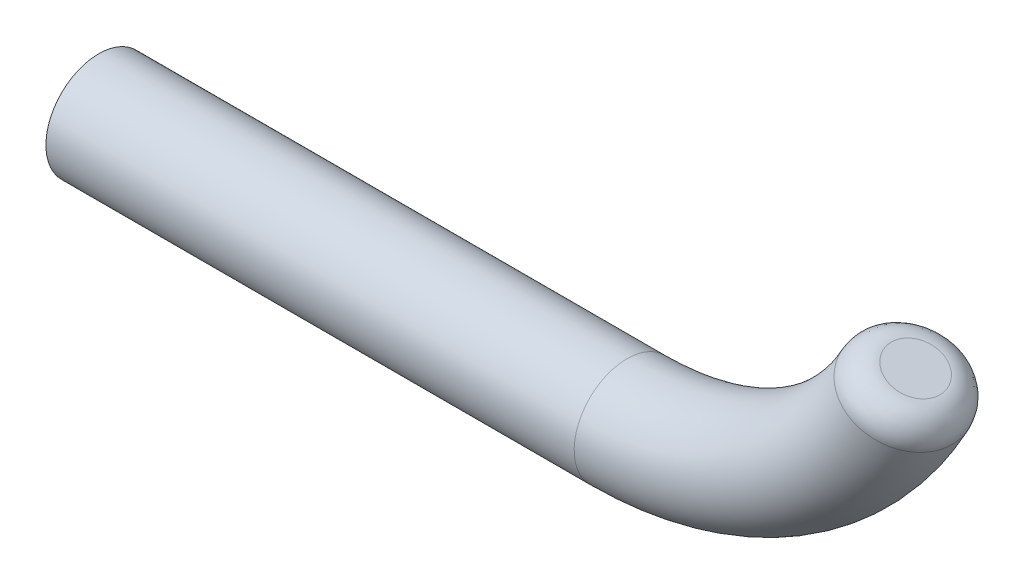
ISO-10303-21;
HEADER;
FILE_DESCRIPTION(('STEP AP214'),'2;1');
FILE_NAME('part.step','',(''),(''),'','','');
FILE_SCHEMA(('AUTOMOTIVE_DESIGN { 1 0 10303 214 1 1 1 1 }'));
ENDSEC;
DATA;
#1=APPLICATION_CONTEXT('core data for automotive mechanical design processes');
#2=APPLICATION_PROTOCOL_DEFINITION('international standard','automotive_design',2000,#1);
#3=PRODUCT_CONTEXT('',#1,'mechanical');
#4=PRODUCT('Part','Part','',(#3));
#5=PRODUCT_RELATED_PRODUCT_CATEGORY('part','',(#4));
#6=PRODUCT_DEFINITION_FORMATION('','',#4);
#7=PRODUCT_DEFINITION_CONTEXT('part definition',#1,'design');
#8=PRODUCT_DEFINITION('design','',#6,#7);
#9=PRODUCT_DEFINITION_SHAPE('','',#8);
#10=(LENGTH_UNIT() NAMED_UNIT(*) SI_UNIT(.MILLI.,.METRE.));
#11=(NAMED_UNIT(*) PLANE_ANGLE_UNIT() SI_UNIT($,.RADIAN.));
#12=(NAMED_UNIT(*) SI_UNIT($,.STERADIAN.) SOLID_ANGLE_UNIT());
#13=UNCERTAINTY_MEASURE_WITH_UNIT(LENGTH_MEASURE(1.E-05),#10,'distance_accuracy_value','');
#14=(GEOMETRIC_REPRESENTATION_CONTEXT(3) GLOBAL_UNCERTAINTY_ASSIGNED_CONTEXT((#13)) GLOBAL_UNIT_ASSIGNED_CONTEXT((#10,
#11,#12)) REPRESENTATION_CONTEXT('',''));
#15=CARTESIAN_POINT('',(0.,0.,0.));
#16=DIRECTION('',(0.,0.,1.));
#17=DIRECTION('',(1.,0.,0.));
#18=AXIS2_PLACEMENT_3D('',#15,#16,#17);
#19=CARTESIAN_POINT('',(50.,25.,0.));
#20=DIRECTION('',(0.,0.,1.));
#21=DIRECTION('',(1.,0.,0.));
#22=AXIS2_PLACEMENT_3D('',#19,#20,#21);
#23=TOROIDAL_SURFACE('',#22,30.,5.);
#24=CARTESIAN_POINT('',(76.6091500946722,10.4224753880065,-4.98838670516629));
#25=CARTESIAN_POINT('',(77.631107553344,12.7195077540693,-5.00254478206829));
#26=CARTESIAN_POINT('',(77.4751472118108,12.7888234614174,-2.49419335258314));
#27=CARTESIAN_POINT('',(76.356901789823,10.547262348215,-5.00758432939226));
#28=CARTESIAN_POINT('',(77.373301598546,12.8340881784239,-5.01009064987202));
#29=CARTESIAN_POINT('',(77.346230607861,12.8461197298395,-2.50379216469613));
#30=CARTESIAN_POINT('',(76.1032877470817,10.6729073912422,-5.00295105048083));
#31=CARTESIAN_POINT('',(77.1152445866172,12.9487801837256,-4.99366594447582));
#32=CARTESIAN_POINT('',(77.2165727009147,12.9037454662601,-2.50147552524041));
#33=CARTESIAN_POINT('',(75.6005186439998,10.9223640527387,-4.94616423498344));
#34=CARTESIAN_POINT('',(76.6071087164915,13.1746183482259,-4.9138708016165));
#35=CARTESIAN_POINT('',(76.9594470454854,13.0180235353398,-2.47308211749173));
#36=CARTESIAN_POINT('',(75.351363626584,11.0461756535563,-4.8940102411893));
#37=CARTESIAN_POINT('',(76.3569975705863,13.2857788575171,-4.85072090842978));
#38=CARTESIAN_POINT('',(76.8319793180867,13.0746758586281,-2.44700512059467));
#39=CARTESIAN_POINT('',(74.8643061594002,11.2885701066347,-4.74356099719807));
#40=CARTESIAN_POINT('',(75.8713177351337,13.5016365621627,-4.68011539458172));
#41=CARTESIAN_POINT('',(76.5827139711742,13.1854604572559,-2.37178049859902));
#42=CARTESIAN_POINT('',(74.626415938627,11.4071472673683,-4.64521681255998));
#43=CARTESIAN_POINT('',(75.6356664191347,13.6063704803845,-4.57280660680407));
#44=CARTESIAN_POINT('',(76.4609225159492,13.2395899929114,-2.32260840627992));
#45=CARTESIAN_POINT('',(74.1689256155032,11.6355138206843,-4.40511984167079));
#46=CARTESIAN_POINT('',(75.1853646692633,13.8065045914385,-4.31769846732381));
#47=CARTESIAN_POINT('',(76.226624664223,13.3437223714564,-2.20255992083536));
#48=CARTESIAN_POINT('',(73.9493254574729,11.7453032400189,-4.26336718757261));
#49=CARTESIAN_POINT('',(74.9705632017953,13.9019719103131,-4.17004393481717));
#50=CARTESIAN_POINT('',(76.1141182394558,13.3937252269085,-2.13168359378636));
#51=CARTESIAN_POINT('',(73.5349268201631,11.9527581373375,-3.94063181431727));
#52=CARTESIAN_POINT('',(74.567603645207,14.0810650465746,-3.83916843315687));
#53=CARTESIAN_POINT('',(75.9017456245872,13.488113055739,-1.97031590715858));
#54=CARTESIAN_POINT('',(73.3400977770043,12.0504385522409,-3.75969819902843));
#55=CARTESIAN_POINT('',(74.3792267628583,14.1647881053963,-3.65607059637285));
#56=CARTESIAN_POINT('',(75.8018638584429,13.5325049518031,-1.87984909951395));
#57=CARTESIAN_POINT('',(72.980485455259,12.2309451522492,-3.36358960079611));
#58=CARTESIAN_POINT('',(74.03333579578,14.3185174240977,-3.2596121209378));
#59=CARTESIAN_POINT('',(75.6174531745704,13.6144652557464,-1.68179480039783));
#60=CARTESIAN_POINT('',(72.8157017029596,12.3137715715512,-3.14841515781513));
#61=CARTESIAN_POINT('',(73.8756195146365,14.3886135490504,-3.04625351401021));
#62=CARTESIAN_POINT('',(75.5329240147835,13.6520337712073,-1.5742075789076));
#63=CARTESIAN_POINT('',(72.5213939902876,12.4618412251153,-2.69067315675977));
#64=CARTESIAN_POINT('',(73.595165453396,14.5132597984906,-2.59598533121115));
#65=CARTESIAN_POINT('',(75.3819191790676,13.7191470315255,-1.34533657837985));
#66=CARTESIAN_POINT('',(72.3917568364636,12.5271408992107,-2.44819718516319));
#67=CARTESIAN_POINT('',(73.4721250089007,14.5679444404886,-2.35908163520195));
#68=CARTESIAN_POINT('',(75.315385548257,13.7487175341079,-1.22409859258124));
#69=CARTESIAN_POINT('',(72.170760829213,12.6385346114708,-1.94216842952516));
#70=CARTESIAN_POINT('',(73.2630834083977,14.6608518184899,-1.86747278758659));
#71=CARTESIAN_POINT('',(75.2019455597456,13.7991353067797,-0.971084214762206));
#72=CARTESIAN_POINT('',(72.0794010760938,12.6846291010443,-1.67861614104623));
#73=CARTESIAN_POINT('',(73.1769209559551,14.6991462417977,-1.61262395394021));
#74=CARTESIAN_POINT('',(75.1550387407256,13.8199827818997,-0.83930807052305));
#75=CARTESIAN_POINT('',(71.9378699513474,12.7560641788695,-1.13899970947719));
#76=CARTESIAN_POINT('',(73.0437451042193,14.7583355092358,-1.0927207434233));
#77=CARTESIAN_POINT('',(75.0823658515969,13.8522818437347,-0.569499854738662));
#78=CARTESIAN_POINT('',(71.8875422586259,12.7814835329288,-0.86298732042111));
#79=CARTESIAN_POINT('',(72.9964739813203,14.7793448971909,-0.827515092757897));
#80=CARTESIAN_POINT('',(75.0565195468187,13.8637690903027,-0.431493660210455));
#81=CARTESIAN_POINT('',(71.8289397774365,12.8110841560056,-0.305379871431318));
#82=CARTESIAN_POINT('',(72.9414908429261,14.8037818475884,-0.292662924922308));
#83=CARTESIAN_POINT('',(75.0264231871125,13.8771452501722,-0.152689935715468));
#84=CARTESIAN_POINT('',(71.8206643558029,12.8152657447923,-0.0237848956166572));
#85=CARTESIAN_POINT('',(72.9337311842532,14.8072305847763,-0.0227907033975826));
#86=CARTESIAN_POINT('',(75.0221728070225,13.8790343079899,-0.0118924478082163));
#87=CARTESIAN_POINT('',(71.8463725417252,12.8022787123746,0.536272138120834));
#88=CARTESIAN_POINT('',(72.9578400879266,14.796515516477,0.514022580885138));
#89=CARTESIAN_POINT('',(75.0353760977587,13.8731661787739,0.268136069060305));
#90=CARTESIAN_POINT('',(71.8802542396975,12.7851615781752,0.814740115610773));
#91=CARTESIAN_POINT('',(72.9896337361098,14.7823850061734,0.781198853673681));
#92=CARTESIAN_POINT('',(75.0527774282734,13.8654322541007,0.407370057805128));
#93=CARTESIAN_POINT('',(71.9891303804021,12.7301882890893,1.36133191204199));
#94=CARTESIAN_POINT('',(73.0919364536641,14.7369171317048,1.3066667070718));
#95=CARTESIAN_POINT('',(75.1086876428653,13.8405832698376,0.680665956020831));
#96=CARTESIAN_POINT('',(72.0641248305328,12.6923321304709,1.62945572912178));
#97=CARTESIAN_POINT('',(73.1625308894193,14.7055418269247,1.56516678123908));
#98=CARTESIAN_POINT('',(75.1471965307409,13.8234682085596,0.814727864560972));
#99=CARTESIAN_POINT('',(72.2531150437608,12.5970137362364,2.14787130308926));
#100=CARTESIAN_POINT('',(73.3408778583628,14.6262765073943,2.0669109023628));
#101=CARTESIAN_POINT('',(75.2442214138795,13.7803460382757,1.07393565154455));
#102=CARTESIAN_POINT('',(72.3671247788157,12.5395444768954,2.39815663289688));
#103=CARTESIAN_POINT('',(73.4487836992752,14.5783183558777,2.31031387387243));
#104=CARTESIAN_POINT('',(75.3027445765491,13.7543357437559,1.19907831644795));
#105=CARTESIAN_POINT('',(72.6308891272829,12.4067336834491,2.87374470586114));
#106=CARTESIAN_POINT('',(73.6993213385505,14.4669682939775,2.77554533381964));
#107=CARTESIAN_POINT('',(75.4381041304061,13.6941759420417,1.43687235293006));
#108=CARTESIAN_POINT('',(72.7806428085271,12.3313926154237,3.09904810029841));
#109=CARTESIAN_POINT('',(73.842130434662,14.4034975845946,2.99747693915557));
#110=CARTESIAN_POINT('',(75.5149400440145,13.6600266471046,1.54952405014908));
#111=CARTESIAN_POINT('',(73.1121220578544,12.1648408658452,3.51897809685509));
#112=CARTESIAN_POINT('',(74.1596760966832,14.2623661792518,3.41451166665942));
#113=CARTESIAN_POINT('',(75.6849641023289,13.5844603989649,1.75948904842767));
#114=CARTESIAN_POINT('',(73.2939354899221,12.0735865798173,3.71351753321379));
#115=CARTESIAN_POINT('',(74.3346959532796,14.1845795763201,3.60956650355832));
#116=CARTESIAN_POINT('',(75.7781971837586,13.543023473885,1.8567587666069));
#117=CARTESIAN_POINT('',(73.6841694510012,11.8780053588178,4.06578662940477));
#118=CARTESIAN_POINT('',(74.7123667022126,14.0167259101277,3.96675054086141));
#119=CARTESIAN_POINT('',(75.9782395459179,13.4541157573697,2.03289331470234));
#120=CARTESIAN_POINT('',(73.8925970987571,11.7736749263896,4.22350640871089));
#121=CARTESIAN_POINT('',(74.9152170208693,13.9265702129469,4.12882499960924));
#122=CARTESIAN_POINT('',(76.0850524589345,13.4066433515846,2.11175320435547));
#123=CARTESIAN_POINT('',(74.3310844314766,11.5545206364173,4.49829628650778));
#124=CARTESIAN_POINT('',(75.3445409633544,13.7357595718424,4.41581444026859));
#125=CARTESIAN_POINT('',(76.3096837474029,13.3068072233764,2.24914814325386));
#126=CARTESIAN_POINT('',(74.5612339750236,11.439653250224,4.61518720362139));
#127=CARTESIAN_POINT('',(75.571276005444,13.6349884420248,4.54044585903501));
#128=CARTESIAN_POINT('',(76.4275478245473,13.25442318909,2.30759360181053));
#129=CARTESIAN_POINT('',(75.0357338989743,11.2032020431357,4.8040087708026));
#130=CARTESIAN_POINT('',(76.0417703634302,13.4258798384754,4.74741470201166));
#131=CARTESIAN_POINT('',(76.6704597107699,13.1464623507689,2.40200438540114));
#132=CARTESIAN_POINT('',(75.2800672465498,11.0816262864289,4.87599217599118));
#133=CARTESIAN_POINT('',(76.2856318982075,13.31749693413,4.82962907699542));
#134=CARTESIAN_POINT('',(76.7954989015123,13.0908893771056,2.43799608799555));
#135=CARTESIAN_POINT('',(75.6837676572324,10.8810622537005,4.95513233444568));
#136=CARTESIAN_POINT('',(76.6909154870488,13.1373708946449,4.92659783360512));
#137=CARTESIAN_POINT('',(77.0020213453717,12.9991016242792,2.47756616722286));
#138=CARTESIAN_POINT('',(75.8409801683631,10.8030309463991,4.9764374246955));
#139=CARTESIAN_POINT('',(76.8495490538749,13.0668670871666,4.95505227148209));
#140=CARTESIAN_POINT('',(77.0824294396,12.9633646935111,2.48821871234776));
#141=CARTESIAN_POINT('',(76.1566036255897,10.6465209063145,5.00042406419231));
#142=CARTESIAN_POINT('',(77.1693818502936,12.9247191776472,4.99360335436955));
#143=CARTESIAN_POINT('',(77.2438234973438,12.8916340011805,2.50021203209615));
#144=CARTESIAN_POINT('',(76.31501457424,10.5680421725777,5.00310557373229));
#145=CARTESIAN_POINT('',(77.3305858022297,12.8530729767867,5.00364529878328));
#146=CARTESIAN_POINT('',(77.324809462091,12.8556402390706,2.50155278686614));
#147=CARTESIAN_POINT('',(76.7254770752763,10.3648811350082,4.98577160756746));
#148=CARTESIAN_POINT('',(77.7504233393442,12.666478515847,5.00533802132427));
#149=CARTESIAN_POINT('',(77.5346097333662,12.7623956740594,2.49288580378375));
#150=CARTESIAN_POINT('',(76.9772040614951,10.2404708917311,4.95131322096451));
#151=CARTESIAN_POINT('',(78.0093981531795,12.5513785985868,4.982319610925));
#152=CARTESIAN_POINT('',(77.663231679102,12.7052303648435,2.47565661048232));
#153=CARTESIAN_POINT('',(77.472284397443,9.99612211515191,4.83562296753504));
#154=CARTESIAN_POINT('',(78.522101075105,12.3235106332866,4.88813346222606));
#155=CARTESIAN_POINT('',(77.9161180784314,12.592836409586,2.41781148376758));
#156=CARTESIAN_POINT('',(77.7156273851959,9.87618910108294,4.75433527637448));
#157=CARTESIAN_POINT('',(78.7757304820169,12.2107864524369,4.81670166120926));
#158=CARTESIAN_POINT('',(78.0403771432213,12.5376101585683,2.37716763818725));
#159=CARTESIAN_POINT('',(78.1866995286211,9.64430315527754,4.54724924285328));
#160=CARTESIAN_POINT('',(79.2697838351,11.9912071843999,4.62677814689758));
#161=CARTESIAN_POINT('',(78.2808550967233,12.4307310681229,2.27362462142664));
#162=CARTESIAN_POINT('',(78.4144346036036,9.5323471975921,4.42146788750309));
#163=CARTESIAN_POINT('',(79.510067344254,11.8844145136648,4.50813839166901));
#164=CARTESIAN_POINT('',(78.3970770336734,12.3790768739229,2.21073394375158));
#165=CARTESIAN_POINT('',(78.8477605353907,9.31954914899579,4.12894032307988));
#166=CARTESIAN_POINT('',(79.9698837916361,11.6800516481617,4.22647325938261));
#167=CARTESIAN_POINT('',(78.6181662520081,12.2808149991075,2.06447016153993));
#168=CARTESIAN_POINT('',(79.0533570049078,9.21870424099346,3.96220453236078));
#169=CARTESIAN_POINT('',(80.1892357377821,11.582561894319,4.06335255107465));
#170=CARTESIAN_POINT('',(78.7230364113993,12.234206039378,1.9811022661803));
#171=CARTESIAN_POINT('',(79.4361991032911,9.03108828148828,3.59277270205361));
#172=CARTESIAN_POINT('',(80.59974935894,11.4001113960266,3.69724406263917));
#173=CARTESIAN_POINT('',(78.9182761736901,12.1474328116932,1.7963863510269));
#174=CARTESIAN_POINT('',(79.6134935487219,8.94429299288262,3.39013988166407));
#175=CARTESIAN_POINT('',(80.7907552168656,11.3152199036152,3.49428973909454));
#176=CARTESIAN_POINT('',(79.0086707455849,12.1072574464066,1.69506994083239));
#177=CARTESIAN_POINT('',(79.9350227651791,8.78699810242634,2.95443778496226));
#178=CARTESIAN_POINT('',(81.1386168801871,11.1606147199168,3.05400859322044));
#179=CARTESIAN_POINT('',(79.1725781556032,12.0344097086207,1.47721889248145));
#180=CARTESIAN_POINT('',(80.0792567519222,8.7164988871622,2.7213677868039));
#181=CARTESIAN_POINT('',(81.295269269447,11.0909914358012,2.81671954078162));
#182=CARTESIAN_POINT('',(79.246090593237,12.0017375141168,1.36068389340199));
#183=CARTESIAN_POINT('',(80.3300577916329,8.59397425760466,2.23219068889864));
#184=CARTESIAN_POINT('',(81.56857129451,10.9695238691066,2.31559206178415));
#185=CARTESIAN_POINT('',(79.3739028699883,11.9449320577829,1.11609534444928));
#186=CARTESIAN_POINT('',(80.4367402786564,8.54189222620131,1.97615727902281));
#187=CARTESIAN_POINT('',(81.6851684008477,10.9177029329565,2.05194366086648));
#188=CARTESIAN_POINT('',(79.4282615885621,11.9207726273057,0.988078639511565));
#189=CARTESIAN_POINT('',(80.6099487188469,8.45735896900637,1.44771811292601));
#190=CARTESIAN_POINT('',(81.874919401718,10.8333691547919,1.50556400797663));
#191=CARTESIAN_POINT('',(79.5165115665367,11.8815504148725,0.723859056463214));
#192=CARTESIAN_POINT('',(80.6764753678513,8.42490740304962,1.17531264049713));
#193=CARTESIAN_POINT('',(81.9479428431035,10.8009142919539,1.22299604659276));
#194=CARTESIAN_POINT('',(79.5504031806003,11.8664874752887,0.58765632024862));
#195=CARTESIAN_POINT('',(80.7673143439819,8.38060138959159,0.622588767329802));
#196=CARTESIAN_POINT('',(82.0477852458428,10.7565398907364,0.648373761501812));
#197=CARTESIAN_POINT('',(79.5966793863072,11.8459202727523,0.311294383664844));
#198=CARTESIAN_POINT('',(80.7917311376974,8.36869597093411,0.342291706811566));
#199=CARTESIAN_POINT('',(82.0746469974162,10.7446013344816,0.356543151467425));
#200=CARTESIAN_POINT('',(79.6091172007827,11.8403923552076,0.171145853405762));
#201=CARTESIAN_POINT('',(80.7979611330819,8.3656580210033,-0.218888663075993));
#202=CARTESIAN_POINT('',(82.0815027322257,10.7415543412329,-0.228014276040381));
#203=CARTESIAN_POINT('',(79.6122907950802,11.8389818688532,-0.109444331537957));
#204=CARTESIAN_POINT('',(80.7797747615065,8.3745252816502,-0.499771966544767));
#205=CARTESIAN_POINT('',(82.0614921933869,10.7504479140502,-0.52052838727934));
#206=CARTESIAN_POINT('',(79.6030267922892,11.843099203427,-0.249885983272321));
#207=CARTESIAN_POINT('',(80.7013702685218,8.41276427634166,-1.05385090354539));
#208=CARTESIAN_POINT('',(81.9752900929987,10.7887599586672,-1.09684936073511));
#209=CARTESIAN_POINT('',(79.5630856129687,11.8608508386805,-0.526925451772756));
#210=CARTESIAN_POINT('',(80.6411952519301,8.44211498243986,-1.32705412237129));
#211=CARTESIAN_POINT('',(81.9092078583558,10.8181298407307,-1.38046291183549));
#212=CARTESIAN_POINT('',(79.5324303962889,11.8744753794271,-0.663527061185853));
#213=CARTESIAN_POINT('',(80.4806091811237,8.52047878715269,-1.85833181167985));
#214=CARTESIAN_POINT('',(81.7331751663498,10.8963665927333,-1.93035469606791));
#215=CARTESIAN_POINT('',(79.4506136847243,11.9108383623447,-0.929165905840098));
#216=CARTESIAN_POINT('',(80.380198040656,8.56949192791697,-2.11640624973013));
#217=CARTESIAN_POINT('',(81.6233464568337,10.9451793525183,-2.19646480820142));
#218=CARTESIAN_POINT('',(79.3994521458809,11.9335768240529,-1.05820312486505));
#219=CARTESIAN_POINT('',(80.1419570833251,8.68585978461289,-2.61032714570713));
#220=CARTESIAN_POINT('',(81.3634871299633,11.0606723866829,-2.70330472941765));
#221=CARTESIAN_POINT('',(79.2780455512817,11.9875353105414,-1.30516357285358));
#222=CARTESIAN_POINT('',(80.0040986500024,8.75322852764294,-2.84615641788241));
#223=CARTESIAN_POINT('',(81.2135941448274,11.1272914911877,-2.94389984806235));
#224=CARTESIAN_POINT('',(79.2077859011096,12.018761821729,-1.42307820894143));
#225=CARTESIAN_POINT('',(79.6949780527742,8.90441614955162,-3.28872728590767));
#226=CARTESIAN_POINT('',(80.8787346002206,11.2761179554574,-3.39224542388501));
#227=CARTESIAN_POINT('',(79.0502127350513,12.0887943399771,-1.64436364295407));
#228=CARTESIAN_POINT('',(79.5237155617867,8.98823518950642,-3.49546859690342));
#229=CARTESIAN_POINT('',(80.6939642381127,11.3582381163943,-3.59994633975824));
#230=CARTESIAN_POINT('',(78.9628990521774,12.1276004212544,-1.74773429845175));
#231=CARTESIAN_POINT('',(79.1522737725845,9.1702078650495,-3.87451713394367));
#232=CARTESIAN_POINT('',(80.2950460123752,11.535535105611,-3.97698025648032));
#233=CARTESIAN_POINT('',(78.77348642001,12.2117838133288,-1.9372585669718));
#234=CARTESIAN_POINT('',(78.9520287065777,9.26839410868431,-4.0467438602101));
#235=CARTESIAN_POINT('',(80.0810339465901,11.6306515792932,-4.14624813115568));
#236=CARTESIAN_POINT('',(78.6713538420628,12.2571760701942,-2.02337193010515));
#237=CARTESIAN_POINT('',(78.5286545407001,9.47622711095056,-4.35136002266356));
#238=CARTESIAN_POINT('',(79.6309376550191,11.830694375547,-4.44126662007328));
#239=CARTESIAN_POINT('',(78.4553605119204,12.3531731058131,-2.17568001133191));
#240=CARTESIAN_POINT('',(78.3055250702377,9.58587405517793,-4.48374881357562));
#241=CARTESIAN_POINT('',(79.3950413519867,11.9355371768947,-4.56711013062543));
#242=CARTESIAN_POINT('',(78.341499569795,12.4037779689799,-2.24187440678784));
#243=CARTESIAN_POINT('',(77.8420220681727,9.81393451428808,-4.70535920403243));
#244=CARTESIAN_POINT('',(78.9078944800953,12.1520468977353,-4.77260275262412));
#245=CARTESIAN_POINT('',(78.1049091009918,12.508929288448,-2.35267960201618));
#246=CARTESIAN_POINT('',(77.6015978903219,9.93237381223718,-4.79444755897702));
#247=CARTESIAN_POINT('',(78.6567491366228,12.2636670503898,-4.85226591151834));
#248=CARTESIAN_POINT('',(77.9821535186935,12.5634873250251,-2.39722377948851));
#249=CARTESIAN_POINT('',(77.1109521171731,10.1744159655884,-4.92638829392689));
#250=CARTESIAN_POINT('',(78.1474670974033,12.4900146233762,-4.96335705041515));
#251=CARTESIAN_POINT('',(77.7315602104896,12.6748621286712,-2.46319414696347));
#252=CARTESIAN_POINT('',(76.8607303627333,10.2980189048656,-4.96923992258713));
#253=CARTESIAN_POINT('',(77.8894301239035,12.6046977227095,-4.99498379314664));
#254=CARTESIAN_POINT('',(77.603722402033,12.7316789324297,-2.48461996129357));
#255=CARTESIAN_POINT('',(76.6091500946722,10.4224753880065,-4.98838670516629));
#256=CARTESIAN_POINT('',(77.631107553344,12.7195077540693,-5.00254478206829));
#257=CARTESIAN_POINT('',(77.4751472118108,12.7888234614174,-2.49419335258314));
#258=(BOUNDED_SURFACE() B_SPLINE_SURFACE(3,2,((#24,#25,#26),(#27,#28,#29),(#30,#31,#32),(#33,
#34,#35),(#36,#37,#38),(#39,#40,#41),(#42,#43,#44),(#45,#46,#47),(#48,#49,#50),(#51,#52,#53),
(#54,#55,#56),(#57,#58,#59),(#60,#61,#62),(#63,#64,#65),(#66,#67,#68),(#69,#70,#71),(#72,#73,
#74),(#75,#76,#77),(#78,#79,#80),(#81,#82,#83),(#84,#85,#86),(#87,#88,#89),(#90,#91,#92),(#93,
#94,#95),(#96,#97,#98),(#99,#100,#101),(#102,#103,#104),(#105,#106,#107),(#108,#109,#110),(#111,
#112,#113),(#114,#115,#116),(#117,#118,#119),(#120,#121,#122),(#123,#124,#125),(#126,#127,#128),
(#129,#130,#131),(#132,#133,#134),(#135,#136,#137),(#138,#139,#140),(#141,#142,#143),(#144,#145,
#146),(#147,#148,#149),(#150,#151,#152),(#153,#154,#155),(#156,#157,#158),(#159,#160,#161),
(#162,#163,#164),(#165,#166,#167),(#168,#169,#170),(#171,#172,#173),(#174,#175,#176),(#177,#178,
#179),(#180,#181,#182),(#183,#184,#185),(#186,#187,#188),(#189,#190,#191),(#192,#193,#194),
(#195,#196,#197),(#198,#199,#200),(#201,#202,#203),(#204,#205,#206),(#207,#208,#209),(#210,#211,
#212),(#213,#214,#215),(#216,#217,#218),(#219,#220,#221),(#222,#223,#224),(#225,#226,#227),
(#228,#229,#230),(#231,#232,#233),(#234,#235,#236),(#237,#238,#239),(#240,#241,#242),(#243,#244,
#245),(#246,#247,#248),(#249,#250,#251),(#252,#253,#254),(#255,#256,#257)),.UNSPECIFIED.,.T.,
.F.,.F.) B_SPLINE_SURFACE_WITH_KNOTS((4,2,2,2,2,2,2,2,2,2,2,2,2,2,2,2,2,2,2,2,2,2,2,2,2,2,2,2,2,
2,2,2,2,2,2,2,2,2,4),(3,3),(0.,0.423706922956387,0.847417922541649,1.27157882264887,
1.69573843145186,2.11936950379965,2.54299389633731,2.96523730079642,3.38747078006211,
3.8080880463692,4.22869897957729,4.64829511080417,5.06789131753887,5.4876379454773,
5.90737362802062,6.32827805610796,6.74929530406695,7.17213767287072,7.59448236738156,
7.85993242985408,8.12538305828799,8.54866281657747,8.97244820591082,9.39607197468265,
9.81958808967628,10.2423656227963,10.6651531843017,11.0866294990285,11.5080985100226,
11.9285204239408,12.3489381265139,12.7689248692926,13.1889125123867,13.609222008811,
14.0295356209795,14.4508184217385,14.8721080458584,15.2946859862289,15.7172707933714),(0.,1.),
.UNSPECIFIED.) GEOMETRIC_REPRESENTATION_ITEM() RATIONAL_B_SPLINE_SURFACE(((1.,0.705108369217168,
1.),(1.,0.706751239397334,1.),(1.,0.708420858420536,1.),(1.,0.711767245583222,1.),(1.,
0.713444013791336,1.),(1.,0.716756850266768,1.),(1.,0.718392873428031,1.),(1.,0.721570674935716,
1.),(1.,0.72311245356904,1.),(1.,0.726048147227225,1.),(1.,0.727442244107909,1.),(1.,
0.7300353077305,1.),(1.,0.731234277548871,1.),(1.,0.733388836682632,1.),(1.,0.734345206661031,
1.),(1.,0.735982654422318,1.),(1.,0.736663738675656,1.),(1.,0.73772139797926,1.),(1.,
0.738099128641814,1.),(1.,0.738539139501108,1.),(1.,0.738601424447399,1.),(1.,0.738408247005003,
1.),(1.,0.738153550878203,1.),(1.,0.737338031082971,1.),(1.,0.736777207359451,1.),(1.,
0.735371521716209,1.),(1.,0.734526558043599,1.),(1.,0.732585433629608,1.),(1.,0.731489279439064,
1.),(1.,0.729083313432982,1.),(1.,0.727772915190938,1.),(1.,0.724987129572325,1.),(1.,
0.72351169806596,1.),(1.,0.720439703746184,1.),(1.,0.718842643552348,1.),(1.,0.715585700156231,
1.),(1.,0.713925893107324,1.),(1.,0.711213491197061,1.),(1.,0.710164381194769,1.),(1.,
0.708072508085369,1.),(1.,0.707029744991798,1.),(1.,0.704346105480931,1.),(1.,0.702718240001884,
1.),(1.,0.699549449644584,1.),(1.,0.698008630944582,1.),(1.,0.69505405668963,1.),(1.,
0.693640252900257,1.),(1.,0.690972799254261,1.),(1.,0.689719108789677,1.),(1.,0.687401413731828,
1.),(1.,0.686337082152775,1.),(1.,0.684418069625221,1.),(1.,0.683563393650283,1.),(1.,
0.682083586326999,1.),(1.,0.681457751282678,1.),(1.,0.680444338612547,1.),(1.,0.680056756858179,
1.),(1.,0.679528045382667,1.),(1.,0.67938630576865,1.),(1.,0.679350114450851,1.),(1.,
0.679455660270011,1.),(1.,0.67991177656534,1.),(1.,0.680262095761884,1.),(1.,0.681200727095083,
1.),(1.,0.681789039741916,1.),(1.,0.683192642728347,1.),(1.,0.684008106664526,1.),(1.,
0.685849350637268,1.),(1.,0.686875132733203,1.),(1.,0.68911815789311,1.),(1.,0.690335836987082,
1.),(1.,0.692934264729169,1.),(1.,0.69431501601814,1.),(1.,0.697212252597236,1.),(1.,
0.698729140053828,1.),(1.,0.701857937933169,1.),(1.,0.703469849899614,1.),(1.,0.705108369217168,1.))) REPRESENTATION_ITEM('') SURFACE());
#259=CARTESIAN_POINT('',(76.6091500946722,10.4224753880065,-4.98838670516629));
#260=CARTESIAN_POINT('',(76.8607303627333,10.2980189048656,-4.96923992258713));
#261=CARTESIAN_POINT('',(77.1109521171731,10.1744159655884,-4.92638829392689));
#262=CARTESIAN_POINT('',(77.6015978903219,9.93237381223718,-4.79444755897702));
#263=CARTESIAN_POINT('',(77.8420220681727,9.81393451428808,-4.70535920403243));
#264=CARTESIAN_POINT('',(78.3055250702377,9.58587405517793,-4.48374881357562));
#265=CARTESIAN_POINT('',(78.5286545407001,9.47622711095056,-4.35136002266356));
#266=CARTESIAN_POINT('',(78.9520287065777,9.26839410868431,-4.04674386021011));
#267=CARTESIAN_POINT('',(79.1522737725845,9.1702078650495,-3.87451713394367));
#268=CARTESIAN_POINT('',(79.5237155617867,8.98823518950642,-3.49546859690342));
#269=CARTESIAN_POINT('',(79.6949780527742,8.90441614955162,-3.28872728590767));
#270=CARTESIAN_POINT('',(80.0040986500024,8.75322852764294,-2.84615641788241));
#271=CARTESIAN_POINT('',(80.1419570833251,8.68585978461289,-2.61032714570713));
#272=CARTESIAN_POINT('',(80.380198040656,8.56949192791697,-2.11640624973013));
#273=CARTESIAN_POINT('',(80.4806091811237,8.52047878715269,-1.85833181167985));
#274=CARTESIAN_POINT('',(80.6411952519301,8.44211498243986,-1.32705412237128));
#275=CARTESIAN_POINT('',(80.7013702685218,8.41276427634166,-1.05385090354539));
#276=CARTESIAN_POINT('',(80.7797747615065,8.3745252816502,-0.499771966544768));
#277=CARTESIAN_POINT('',(80.7979611330819,8.3656580210033,-0.218888663075993));
#278=CARTESIAN_POINT('',(80.7917311376974,8.36869597093411,0.342291706811567));
#279=CARTESIAN_POINT('',(80.7673143439819,8.38060138959159,0.622588767329802));
#280=CARTESIAN_POINT('',(80.6764753678513,8.42490740304962,1.17531264049713));
#281=CARTESIAN_POINT('',(80.6099487188469,8.45735896900637,1.44771811292601));
#282=CARTESIAN_POINT('',(80.4367402786564,8.54189222620131,1.97615727902281));
#283=CARTESIAN_POINT('',(80.3300577916329,8.59397425760466,2.23219068889864));
#284=CARTESIAN_POINT('',(80.0792567519222,8.7164988871622,2.7213677868039));
#285=CARTESIAN_POINT('',(79.9350227651791,8.78699810242634,2.95443778496226));
#286=CARTESIAN_POINT('',(79.6134935487219,8.94429299288262,3.39013988166407));
#287=CARTESIAN_POINT('',(79.4361991032911,9.03108828148828,3.59277270205361));
#288=CARTESIAN_POINT('',(79.0533570049078,9.21870424099346,3.96220453236078));
#289=CARTESIAN_POINT('',(78.8477605353907,9.31954914899579,4.12894032307988));
#290=CARTESIAN_POINT('',(78.4144346036036,9.5323471975921,4.42146788750309));
#291=CARTESIAN_POINT('',(78.1866995286211,9.64430315527754,4.54724924285328));
#292=CARTESIAN_POINT('',(77.7156273851959,9.87618910108294,4.75433527637448));
#293=CARTESIAN_POINT('',(77.472284397443,9.99612211515191,4.83562296753504));
#294=CARTESIAN_POINT('',(76.9772040614951,10.2404708917311,4.95131322096451));
#295=CARTESIAN_POINT('',(76.7254770752763,10.3648811350082,4.98577160756746));
#296=CARTESIAN_POINT('',(76.31501457424,10.5680421725777,5.00310557373229));
#297=CARTESIAN_POINT('',(76.1566036255897,10.6465209063145,5.00042406419231));
#298=CARTESIAN_POINT('',(75.8409801683631,10.8030309463991,4.9764374246955));
#299=CARTESIAN_POINT('',(75.6837676572324,10.8810622537005,4.95513233444568));
#300=CARTESIAN_POINT('',(75.2800672465498,11.0816262864289,4.87599217599118));
#301=CARTESIAN_POINT('',(75.0357338989743,11.2032020431357,4.8040087708026));
#302=CARTESIAN_POINT('',(74.5612339750236,11.439653250224,4.61518720362139));
#303=CARTESIAN_POINT('',(74.3310844314766,11.5545206364173,4.49829628650779));
#304=CARTESIAN_POINT('',(73.8925970987571,11.7736749263896,4.22350640871089));
#305=CARTESIAN_POINT('',(73.6841694510012,11.8780053588178,4.06578662940477));
#306=CARTESIAN_POINT('',(73.2939354899221,12.0735865798173,3.71351753321379));
#307=CARTESIAN_POINT('',(73.1121220578544,12.1648408658452,3.51897809685509));
#308=CARTESIAN_POINT('',(72.7806428085271,12.3313926154237,3.09904810029841));
#309=CARTESIAN_POINT('',(72.6308891272829,12.4067336834491,2.87374470586114));
#310=CARTESIAN_POINT('',(72.3671247788157,12.5395444768954,2.39815663289688));
#311=CARTESIAN_POINT('',(72.2531150437608,12.5970137362364,2.14787130308926));
#312=CARTESIAN_POINT('',(72.0641248305328,12.6923321304709,1.62945572912178));
#313=CARTESIAN_POINT('',(71.9891303804022,12.7301882890893,1.36133191204199));
#314=CARTESIAN_POINT('',(71.8802542396975,12.7851615781752,0.814740115610773));
#315=CARTESIAN_POINT('',(71.8463725417252,12.8022787123746,0.536272138120833));
#316=CARTESIAN_POINT('',(71.8206643558029,12.8152657447923,-0.0237848956166581));
#317=CARTESIAN_POINT('',(71.8289397774365,12.8110841560056,-0.305379871431317));
#318=CARTESIAN_POINT('',(71.8875422586259,12.7814835329288,-0.862987320421109));
#319=CARTESIAN_POINT('',(71.9378699513474,12.7560641788695,-1.13899970947719));
#320=CARTESIAN_POINT('',(72.0794010760938,12.6846291010443,-1.67861614104623));
#321=CARTESIAN_POINT('',(72.170760829213,12.6385346114708,-1.94216842952516));
#322=CARTESIAN_POINT('',(72.3917568364636,12.5271408992107,-2.44819718516319));
#323=CARTESIAN_POINT('',(72.5213939902876,12.4618412251153,-2.69067315675978));
#324=CARTESIAN_POINT('',(72.8157017029596,12.3137715715512,-3.14841515781513));
#325=CARTESIAN_POINT('',(72.980485455259,12.2309451522492,-3.36358960079611));
#326=CARTESIAN_POINT('',(73.3400977770043,12.0504385522409,-3.75969819902843));
#327=CARTESIAN_POINT('',(73.5349268201631,11.9527581373375,-3.94063181431727));
#328=CARTESIAN_POINT('',(73.9493254574729,11.7453032400189,-4.26336718757261));
#329=CARTESIAN_POINT('',(74.1689256155032,11.6355138206843,-4.40511984167079));
#330=CARTESIAN_POINT('',(74.626415938627,11.4071472673683,-4.64521681255998));
#331=CARTESIAN_POINT('',(74.8643061594002,11.2885701066346,-4.74356099719807));
#332=CARTESIAN_POINT('',(75.351363626584,11.0461756535563,-4.8940102411893));
#333=CARTESIAN_POINT('',(75.6005186439998,10.9223640527387,-4.94616423498344));
#334=CARTESIAN_POINT('',(76.1032877470817,10.6729073912422,-5.00295105048083));
#335=CARTESIAN_POINT('',(76.356901789823,10.547262348215,-5.00758432939226));
#336=CARTESIAN_POINT('',(76.6091500946722,10.4224753880065,-4.98838670516629));
#337=B_SPLINE_CURVE_WITH_KNOTS('',3,(#259,#260,#261,#262,#263,#264,#265,#266,#267,#268,#269,
#270,#271,#272,#273,#274,#275,#276,#277,#278,#279,#280,#281,#282,#283,#284,#285,#286,#287,#288,
#289,#290,#291,#292,#293,#294,#295,#296,#297,#298,#299,#300,#301,#302,#303,#304,#305,#306,#307,
#308,#309,#310,#311,#312,#313,#314,#315,#316,#317,#318,#319,#320,#321,#322,#323,#324,#325,#326,
#327,#328,#329,#330,#331,#332,#333,#334,#335,#336),.UNSPECIFIED.,.T.,.F.,(4,2,2,2,2,2,2,2,2,2,2,
2,2,2,2,2,2,2,2,2,2,2,2,2,2,2,2,2,2,2,2,2,2,2,2,2,2,2,4),(0.,0.422584807142514,
0.845162747512927,1.26645237163286,1.68773517239191,2.10804878456038,2.52835828098463,
2.94834592407878,3.36833266685744,3.78875036943061,4.20917228334873,4.63064129434291,
5.05211760906965,5.47490517057502,5.89768270369509,6.32119881868871,6.74482258746055,
7.1686079767939,7.59188773508338,7.85733836351729,8.12278842598981,8.54513312050064,
8.96797548930442,9.38899273726341,9.80989716535075,10.2296328478941,10.6493794758325,
11.0689756825672,11.4885718137941,11.9091827470022,12.3298000133093,12.752033492575,
13.1742768970341,13.5979012895717,14.0215323619195,14.4456919707225,14.8698528708297,
15.293563870415,15.7172707933714),.UNSPECIFIED.);
#338=CARTESIAN_POINT('',(76.6091500946722,10.4224753880065,-4.98838670516629));
#339=VERTEX_POINT('',#338);
#340=EDGE_CURVE('E10',#339,#339,#337,.T.);
#341=ORIENTED_EDGE('',*,*,#340,.T.);
#342=EDGE_LOOP('',(#341));
#343=FACE_BOUND('',#342,.T.);
#344=CARTESIAN_POINT('',(50.,-5.,0.));
#345=DIRECTION('',(1.,0.,0.));
#346=DIRECTION('',(0.,0.,-1.));
#347=AXIS2_PLACEMENT_3D('',#344,#345,#346);
#348=CIRCLE('',#347,5.);
#349=CARTESIAN_POINT('',(50.,-5.,-5.));
#350=VERTEX_POINT('',#349);
#351=EDGE_CURVE('E45',#350,#350,#348,.T.);
#352=ORIENTED_EDGE('',*,*,#351,.T.);
#353=EDGE_LOOP('',(#352));
#354=FACE_BOUND('',#353,.T.);
#355=ADVANCED_FACE('F31',(#343,#354),#23,.T.);
#356=CARTESIAN_POINT('',(50.,-5.,0.));
#357=DIRECTION('',(-1.,0.,0.));
#358=DIRECTION('',(0.,-1.,0.));
#359=AXIS2_PLACEMENT_3D('',#356,#357,#358);
#360=CYLINDRICAL_SURFACE('',#359,5.);
#361=ORIENTED_EDGE('',*,*,#351,.F.);
#362=EDGE_LOOP('',(#361));
#363=FACE_BOUND('',#362,.T.);
#364=CARTESIAN_POINT('',(0.,-5.,0.));
#365=DIRECTION('',(1.,0.,0.));
#366=DIRECTION('',(0.,0.,-1.));
#367=AXIS2_PLACEMENT_3D('',#364,#365,#366);
#368=CIRCLE('',#367,5.);
#369=CARTESIAN_POINT('',(0.,-5.,-5.));
#370=VERTEX_POINT('',#369);
#371=EDGE_CURVE('E89',#370,#370,#368,.T.);
#372=ORIENTED_EDGE('',*,*,#371,.T.);
#373=EDGE_LOOP('',(#372));
#374=FACE_BOUND('',#373,.T.);
#375=ADVANCED_FACE('F72',(#363,#374),#360,.T.);
#376=CARTESIAN_POINT('',(77.4143464586077,12.8158460183965,0.));
#377=DIRECTION('',(0.40613846605345,0.913811548620256,0.));
#378=DIRECTION('',(0.,0.,-1.));
#379=AXIS2_PLACEMENT_3D('',#376,#377,#378);
#380=PLANE('',#379);
#381=CARTESIAN_POINT('',(77.4751472118108,12.7888234614174,-2.49419335258314));
#382=CARTESIAN_POINT('',(77.346230607861,12.8461197298395,-2.50379216469612));
#383=CARTESIAN_POINT('',(77.2165727009146,12.9037454662601,-2.50147552524041));
#384=CARTESIAN_POINT('',(76.9594470454853,13.0180235353398,-2.47308211749173));
#385=CARTESIAN_POINT('',(76.8319793180867,13.0746758586281,-2.44700512059467));
#386=CARTESIAN_POINT('',(76.5827139711742,13.1854604572559,-2.37178049859901));
#387=CARTESIAN_POINT('',(76.4609225159492,13.2395899929114,-2.32260840627992));
#388=CARTESIAN_POINT('',(76.226624664223,13.3437223714564,-2.20255992083536));
#389=CARTESIAN_POINT('',(76.1141182394558,13.3937252269085,-2.13168359378636));
#390=CARTESIAN_POINT('',(75.9017456245872,13.488113055739,-1.97031590715858));
#391=CARTESIAN_POINT('',(75.8018638584429,13.5325049518031,-1.87984909951395));
#392=CARTESIAN_POINT('',(75.6174531745704,13.6144652557464,-1.68179480039783));
#393=CARTESIAN_POINT('',(75.5329240147835,13.6520337712073,-1.5742075789076));
#394=CARTESIAN_POINT('',(75.3819191790676,13.7191470315255,-1.34533657837985));
#395=CARTESIAN_POINT('',(75.315385548257,13.7487175341079,-1.22409859258124));
#396=CARTESIAN_POINT('',(75.2019455597456,13.7991353067797,-0.971084214762205));
#397=CARTESIAN_POINT('',(75.1550387407256,13.8199827818997,-0.83930807052305));
#398=CARTESIAN_POINT('',(75.0823658515969,13.8522818437347,-0.569499854738662));
#399=CARTESIAN_POINT('',(75.0565195468187,13.8637690903027,-0.431493660210455));
#400=CARTESIAN_POINT('',(75.0264231871125,13.8771452501722,-0.152689935715468));
#401=CARTESIAN_POINT('',(75.0221728070225,13.8790343079899,-0.0118924478082162));
#402=CARTESIAN_POINT('',(75.0353760977587,13.8731661787739,0.268136069060305));
#403=CARTESIAN_POINT('',(75.0527774282734,13.8654322541007,0.407370057805128));
#404=CARTESIAN_POINT('',(75.1086876428653,13.8405832698376,0.68066595602083));
#405=CARTESIAN_POINT('',(75.1471965307409,13.8234682085596,0.814727864560972));
#406=CARTESIAN_POINT('',(75.2442214138795,13.7803460382757,1.07393565154455));
#407=CARTESIAN_POINT('',(75.3027445765491,13.7543357437559,1.19907831644795));
#408=CARTESIAN_POINT('',(75.4381041304061,13.6941759420417,1.43687235293006));
#409=CARTESIAN_POINT('',(75.5149400440145,13.6600266471046,1.54952405014908));
#410=CARTESIAN_POINT('',(75.6849641023289,13.5844603989649,1.75948904842768));
#411=CARTESIAN_POINT('',(75.7781971837586,13.543023473885,1.8567587666069));
#412=CARTESIAN_POINT('',(75.9782395459179,13.4541157573697,2.03289331470234));
#413=CARTESIAN_POINT('',(76.0850524589345,13.4066433515846,2.11175320435547));
#414=CARTESIAN_POINT('',(76.3096837474029,13.3068072233764,2.24914814325386));
#415=CARTESIAN_POINT('',(76.4275478245473,13.25442318909,2.30759360181053));
#416=CARTESIAN_POINT('',(76.6704597107699,13.1464623507689,2.40200438540114));
#417=CARTESIAN_POINT('',(76.7954989015123,13.0908893771056,2.43799608799555));
#418=CARTESIAN_POINT('',(77.0020213453716,12.9991016242792,2.47756616722286));
#419=CARTESIAN_POINT('',(77.0824294396,12.9633646935111,2.48821871234776));
#420=CARTESIAN_POINT('',(77.2438234973438,12.8916340011805,2.50021203209615));
#421=CARTESIAN_POINT('',(77.324809462091,12.8556402390706,2.50155278686614));
#422=CARTESIAN_POINT('',(77.5346097333662,12.7623956740594,2.49288580378375));
#423=CARTESIAN_POINT('',(77.663231679102,12.7052303648435,2.47565661048232));
#424=CARTESIAN_POINT('',(77.9161180784314,12.592836409586,2.41781148376758));
#425=CARTESIAN_POINT('',(78.0403771432213,12.5376101585683,2.37716763818725));
#426=CARTESIAN_POINT('',(78.2808550967233,12.4307310681229,2.27362462142664));
#427=CARTESIAN_POINT('',(78.3970770336734,12.3790768739229,2.21073394375158));
#428=CARTESIAN_POINT('',(78.6181662520081,12.2808149991075,2.06447016153993));
#429=CARTESIAN_POINT('',(78.7230364113993,12.234206039378,1.9811022661803));
#430=CARTESIAN_POINT('',(78.9182761736901,12.1474328116932,1.7963863510269));
#431=CARTESIAN_POINT('',(79.0086707455849,12.1072574464066,1.69506994083239));
#432=CARTESIAN_POINT('',(79.1725781556032,12.0344097086207,1.47721889248145));
#433=CARTESIAN_POINT('',(79.246090593237,12.0017375141168,1.36068389340199));
#434=CARTESIAN_POINT('',(79.3739028699883,11.9449320577829,1.11609534444928));
#435=CARTESIAN_POINT('',(79.4282615885621,11.9207726273057,0.988078639511565));
#436=CARTESIAN_POINT('',(79.5165115665367,11.8815504148725,0.723859056463214));
#437=CARTESIAN_POINT('',(79.5504031806003,11.8664874752887,0.58765632024862));
#438=CARTESIAN_POINT('',(79.5966793863073,11.8459202727523,0.311294383664844));
#439=CARTESIAN_POINT('',(79.6091172007827,11.8403923552076,0.171145853405763));
#440=CARTESIAN_POINT('',(79.6122907950802,11.8389818688532,-0.109444331537957));
#441=CARTESIAN_POINT('',(79.6030267922892,11.843099203427,-0.249885983272321));
#442=CARTESIAN_POINT('',(79.5630856129687,11.8608508386805,-0.526925451772756));
#443=CARTESIAN_POINT('',(79.5324303962889,11.8744753794271,-0.663527061185852));
#444=CARTESIAN_POINT('',(79.4506136847243,11.9108383623447,-0.929165905840098));
#445=CARTESIAN_POINT('',(79.3994521458809,11.9335768240529,-1.05820312486505));
#446=CARTESIAN_POINT('',(79.2780455512817,11.9875353105414,-1.30516357285358));
#447=CARTESIAN_POINT('',(79.2077859011096,12.018761821729,-1.42307820894143));
#448=CARTESIAN_POINT('',(79.0502127350513,12.0887943399771,-1.64436364295407));
#449=CARTESIAN_POINT('',(78.9628990521774,12.1276004212544,-1.74773429845175));
#450=CARTESIAN_POINT('',(78.77348642001,12.2117838133288,-1.9372585669718));
#451=CARTESIAN_POINT('',(78.6713538420628,12.2571760701942,-2.02337193010515));
#452=CARTESIAN_POINT('',(78.4553605119204,12.3531731058131,-2.17568001133191));
#453=CARTESIAN_POINT('',(78.341499569795,12.4037779689799,-2.24187440678784));
#454=CARTESIAN_POINT('',(78.1049091009918,12.508929288448,-2.35267960201618));
#455=CARTESIAN_POINT('',(77.9821535186935,12.5634873250251,-2.39722377948851));
#456=CARTESIAN_POINT('',(77.7315602104896,12.6748621286712,-2.46319414696347));
#457=CARTESIAN_POINT('',(77.603722402033,12.7316789324297,-2.48461996129357));
#458=CARTESIAN_POINT('',(77.4751472118108,12.7888234614174,-2.49419335258314));
#459=B_SPLINE_CURVE_WITH_KNOTS('',3,(#381,#382,#383,#384,#385,#386,#387,#388,#389,#390,#391,
#392,#393,#394,#395,#396,#397,#398,#399,#400,#401,#402,#403,#404,#405,#406,#407,#408,#409,#410,
#411,#412,#413,#414,#415,#416,#417,#418,#419,#420,#421,#422,#423,#424,#425,#426,#427,#428,#429,
#430,#431,#432,#433,#434,#435,#436,#437,#438,#439,#440,#441,#442,#443,#444,#445,#446,#447,#448,
#449,#450,#451,#452,#453,#454,#455,#456,#457,#458),.UNSPECIFIED.,.T.,.F.,(4,2,2,2,2,2,2,2,2,2,2,
2,2,2,2,2,2,2,2,2,2,2,2,2,2,2,2,2,2,2,2,2,2,2,2,2,2,2,4),(0.,0.423706922956387,
0.847417922541649,1.27157882264887,1.69573843145186,2.11936950379965,2.54299389633731,
2.96523730079642,3.38747078006211,3.8080880463692,4.22869897957729,4.64829511080417,
5.06789131753887,5.4876379454773,5.90737362802062,6.32827805610796,6.74929530406695,
7.17213767287072,7.59448236738156,7.85993242985408,8.12538305828799,8.54866281657747,
8.97244820591082,9.39607197468265,9.81958808967628,10.2423656227963,10.6651531843017,
11.0866294990285,11.5080985100226,11.9285204239408,12.3489381265139,12.7689248692926,
13.1889125123867,13.609222008811,14.0295356209795,14.4508184217385,14.8721080458584,
15.2946859862289,15.7172707933714),.UNSPECIFIED.);
#460=CARTESIAN_POINT('',(77.4751472118108,12.7888234614174,-2.49419335258314));
#461=VERTEX_POINT('',#460);
#462=EDGE_CURVE('E41',#461,#461,#459,.T.);
#463=ORIENTED_EDGE('',*,*,#462,.T.);
#464=EDGE_LOOP('',(#463));
#465=FACE_BOUND('',#464,.T.);
#466=ADVANCED_FACE('F68',(#465),#380,.T.);
#467=CARTESIAN_POINT('',(0.,-5.,0.));
#468=DIRECTION('',(1.,0.,0.));
#469=DIRECTION('',(0.,0.,-1.));
#470=AXIS2_PLACEMENT_3D('',#467,#468,#469);
#471=PLANE('',#470);
#472=ORIENTED_EDGE('',*,*,#371,.F.);
#473=EDGE_LOOP('',(#472));
#474=FACE_BOUND('',#473,.T.);
#475=ADVANCED_FACE('F64',(#474),#471,.F.);
#476=CARTESIAN_POINT('',(76.4598010466771,10.5042945898667,-2.49419335258314));
#477=DIRECTION('',(0.911703599118674,-0.405201599608304,0.0678838053509729));
#478=DIRECTION('',(0.0597396191980071,-0.0327276807440914,-0.997677341033257));
#479=AXIS2_PLACEMENT_3D('',#476,#477,#478);
#480=CIRCLE('',#479,2.5);
#481=EDGE_CURVE('',#339,#461,#480,.T.);
#482=ORIENTED_EDGE('',*,*,#340,.F.);
#483=ORIENTED_EDGE('',*,*,#462,.F.);
#484=ORIENTED_EDGE('',*,*,#481,.T.);
#485=ORIENTED_EDGE('',*,*,#481,.F.);
#486=EDGE_LOOP('',(#482,#484,#483,#485));
#487=FACE_BOUND('',#486,.T.);
#488=ADVANCED_FACE('F61',(#487),#258,.T.);
#489=CLOSED_SHELL('',(#355,#375,#466,#475,#488));
#490=MANIFOLD_SOLID_BREP('B2',#489);
#491=ADVANCED_BREP_SHAPE_REPRESENTATION('',(#18,#490),#14);
#492=SHAPE_DEFINITION_REPRESENTATION(#9,#491);
ENDSEC;
END-ISO-10303-21;
